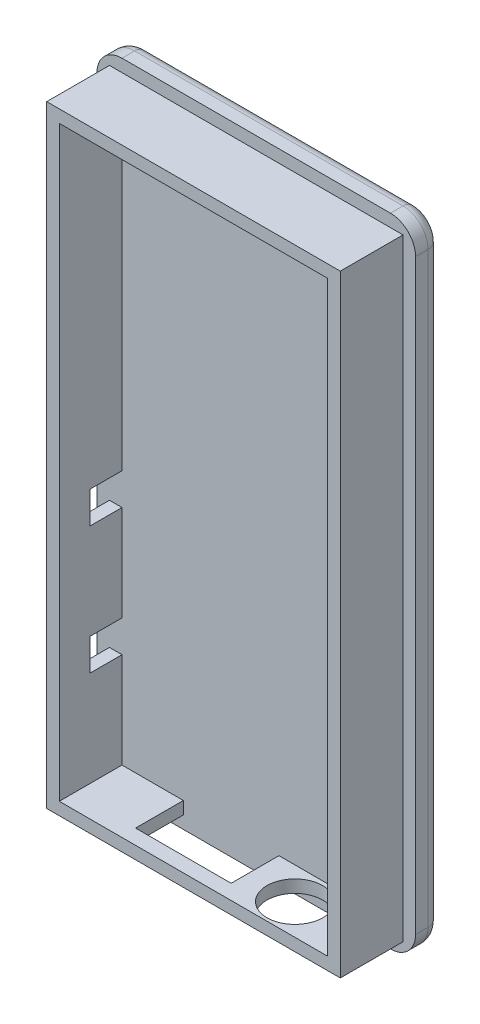
ISO-10303-21;
HEADER;
FILE_DESCRIPTION(('STEP AP214'),'2;1');
FILE_NAME('part.step','',(''),(''),'','','');
FILE_SCHEMA(('AUTOMOTIVE_DESIGN { 1 0 10303 214 1 1 1 1 }'));
ENDSEC;
DATA;
#1=APPLICATION_CONTEXT('core data for automotive mechanical design processes');
#2=APPLICATION_PROTOCOL_DEFINITION('international standard','automotive_design',2000,#1);
#3=PRODUCT_CONTEXT('',#1,'mechanical');
#4=PRODUCT('Part','Part','',(#3));
#5=PRODUCT_RELATED_PRODUCT_CATEGORY('part','',(#4));
#6=PRODUCT_DEFINITION_FORMATION('','',#4);
#7=PRODUCT_DEFINITION_CONTEXT('part definition',#1,'design');
#8=PRODUCT_DEFINITION('design','',#6,#7);
#9=PRODUCT_DEFINITION_SHAPE('','',#8);
#10=(LENGTH_UNIT() NAMED_UNIT(*) SI_UNIT(.MILLI.,.METRE.));
#11=(NAMED_UNIT(*) PLANE_ANGLE_UNIT() SI_UNIT($,.RADIAN.));
#12=(NAMED_UNIT(*) SI_UNIT($,.STERADIAN.) SOLID_ANGLE_UNIT());
#13=UNCERTAINTY_MEASURE_WITH_UNIT(LENGTH_MEASURE(1.E-05),#10,'distance_accuracy_value','');
#14=(GEOMETRIC_REPRESENTATION_CONTEXT(3) GLOBAL_UNCERTAINTY_ASSIGNED_CONTEXT((#13)) GLOBAL_UNIT_ASSIGNED_CONTEXT((#10,
#11,#12)) REPRESENTATION_CONTEXT('',''));
#15=CARTESIAN_POINT('',(0.,0.,0.));
#16=DIRECTION('',(0.,0.,1.));
#17=DIRECTION('',(1.,0.,0.));
#18=AXIS2_PLACEMENT_3D('',#15,#16,#17);
#19=CARTESIAN_POINT('',(0.,0.,2.00000108));
#20=DIRECTION('',(1.,0.,0.));
#21=DIRECTION('',(0.,1.,0.));
#22=AXIS2_PLACEMENT_3D('',#19,#20,#21);
#23=PLANE('',#22);
#24=DIRECTION('',(0.,0.,-1.));
#25=VECTOR('',#24,1.);
#26=CARTESIAN_POINT('',(0.,48.799999936,2.00000108));
#27=LINE('',#26,#25);
#28=CARTESIAN_POINT('',(0.,48.799999936,2.00000108));
#29=VERTEX_POINT('',#28);
#30=CARTESIAN_POINT('',(0.,48.799999936,1.000000032));
#31=VERTEX_POINT('',#30);
#32=EDGE_CURVE('E551',#29,#31,#27,.T.);
#33=ORIENTED_EDGE('',*,*,#32,.T.);
#34=DIRECTION('',(0.,-1.,0.));
#35=VECTOR('',#34,1.);
#36=CARTESIAN_POINT('',(0.,2.000000064,1.000000032));
#37=LINE('',#36,#35);
#38=CARTESIAN_POINT('',(0.,2.000000064,1.000000032));
#39=VERTEX_POINT('',#38);
#40=EDGE_CURVE('E11',#31,#39,#37,.T.);
#41=ORIENTED_EDGE('',*,*,#40,.T.);
#42=DIRECTION('',(0.,0.,-1.));
#43=VECTOR('',#42,1.);
#44=CARTESIAN_POINT('',(0.,2.000000064,2.00000108));
#45=LINE('',#44,#43);
#46=CARTESIAN_POINT('',(0.,2.000000064,2.00000108));
#47=VERTEX_POINT('',#46);
#48=EDGE_CURVE('E553',#39,#47,#45,.F.);
#49=ORIENTED_EDGE('',*,*,#48,.T.);
#50=DIRECTION('',(0.,-1.,0.));
#51=VECTOR('',#50,1.);
#52=CARTESIAN_POINT('',(0.,0.,2.00000108));
#53=LINE('',#52,#51);
#54=EDGE_CURVE('E564',#29,#47,#53,.T.);
#55=ORIENTED_EDGE('',*,*,#54,.F.);
#56=EDGE_LOOP('',(#33,#41,#49,#55));
#57=FACE_BOUND('',#56,.T.);
#58=ADVANCED_FACE('F35',(#57),#23,.F.);
#59=CARTESIAN_POINT('',(0.,0.,2.00000108));
#60=DIRECTION('',(0.,1.,0.));
#61=DIRECTION('',(0.,0.,1.));
#62=AXIS2_PLACEMENT_3D('',#59,#60,#61);
#63=PLANE('',#62);
#64=DIRECTION('',(0.,0.,-1.));
#65=VECTOR('',#64,1.);
#66=CARTESIAN_POINT('',(2.000000064,0.,2.00000108));
#67=LINE('',#66,#65);
#68=CARTESIAN_POINT('',(2.000000064,0.,2.00000108));
#69=VERTEX_POINT('',#68);
#70=CARTESIAN_POINT('',(2.000000064,0.,1.000000032));
#71=VERTEX_POINT('',#70);
#72=EDGE_CURVE('E533',#69,#71,#67,.T.);
#73=ORIENTED_EDGE('',*,*,#72,.T.);
#74=DIRECTION('',(1.,0.,0.));
#75=VECTOR('',#74,1.);
#76=CARTESIAN_POINT('',(23.399999936,0.,1.000000032));
#77=LINE('',#76,#75);
#78=CARTESIAN_POINT('',(23.399999936,0.,1.000000032));
#79=VERTEX_POINT('',#78);
#80=EDGE_CURVE('E507',#71,#79,#77,.T.);
#81=ORIENTED_EDGE('',*,*,#80,.T.);
#82=DIRECTION('',(0.,0.,-1.));
#83=VECTOR('',#82,1.);
#84=CARTESIAN_POINT('',(23.399999936,0.,2.00000108));
#85=LINE('',#84,#83);
#86=CARTESIAN_POINT('',(23.399999936,0.,2.00000108));
#87=VERTEX_POINT('',#86);
#88=EDGE_CURVE('E536',#79,#87,#85,.F.);
#89=ORIENTED_EDGE('',*,*,#88,.T.);
#90=DIRECTION('',(1.,0.,0.));
#91=VECTOR('',#90,1.);
#92=CARTESIAN_POINT('',(0.,0.,2.00000108));
#93=LINE('',#92,#91);
#94=EDGE_CURVE('E561',#69,#87,#93,.T.);
#95=ORIENTED_EDGE('',*,*,#94,.F.);
#96=EDGE_LOOP('',(#73,#81,#89,#95));
#97=FACE_BOUND('',#96,.T.);
#98=ADVANCED_FACE('F409',(#97),#63,.F.);
#99=CARTESIAN_POINT('',(25.4,0.,2.00000108));
#100=DIRECTION('',(-1.,0.,0.));
#101=DIRECTION('',(0.,-1.,0.));
#102=AXIS2_PLACEMENT_3D('',#99,#100,#101);
#103=PLANE('',#102);
#104=DIRECTION('',(0.,0.,-1.));
#105=VECTOR('',#104,1.);
#106=CARTESIAN_POINT('',(25.4,2.000000064,2.00000108));
#107=LINE('',#106,#105);
#108=CARTESIAN_POINT('',(25.4,2.000000064,2.00000108));
#109=VERTEX_POINT('',#108);
#110=CARTESIAN_POINT('',(25.4,2.000000064,1.000000032));
#111=VERTEX_POINT('',#110);
#112=EDGE_CURVE('E528',#109,#111,#107,.T.);
#113=ORIENTED_EDGE('',*,*,#112,.T.);
#114=DIRECTION('',(0.,1.,0.));
#115=VECTOR('',#114,1.);
#116=CARTESIAN_POINT('',(25.4,48.799999936,1.000000032));
#117=LINE('',#116,#115);
#118=CARTESIAN_POINT('',(25.4,48.799999936,1.000000032));
#119=VERTEX_POINT('',#118);
#120=EDGE_CURVE('E474',#111,#119,#117,.T.);
#121=ORIENTED_EDGE('',*,*,#120,.T.);
#122=DIRECTION('',(0.,0.,-1.));
#123=VECTOR('',#122,1.);
#124=CARTESIAN_POINT('',(25.4,48.799999936,2.00000108));
#125=LINE('',#124,#123);
#126=CARTESIAN_POINT('',(25.4,48.799999936,2.00000108));
#127=VERTEX_POINT('',#126);
#128=EDGE_CURVE('E531',#119,#127,#125,.F.);
#129=ORIENTED_EDGE('',*,*,#128,.T.);
#130=DIRECTION('',(0.,1.,0.));
#131=VECTOR('',#130,1.);
#132=CARTESIAN_POINT('',(25.4,0.,2.00000108));
#133=LINE('',#132,#131);
#134=EDGE_CURVE('E558',#109,#127,#133,.T.);
#135=ORIENTED_EDGE('',*,*,#134,.F.);
#136=EDGE_LOOP('',(#113,#121,#129,#135));
#137=FACE_BOUND('',#136,.T.);
#138=ADVANCED_FACE('F415',(#137),#103,.F.);
#139=CARTESIAN_POINT('',(0.,50.8,2.00000108));
#140=DIRECTION('',(0.,-1.,0.));
#141=DIRECTION('',(0.,0.,-1.));
#142=AXIS2_PLACEMENT_3D('',#139,#140,#141);
#143=PLANE('',#142);
#144=DIRECTION('',(0.,0.,-1.));
#145=VECTOR('',#144,1.);
#146=CARTESIAN_POINT('',(23.399999936,50.8,2.00000108));
#147=LINE('',#146,#145);
#148=CARTESIAN_POINT('',(23.399999936,50.8,2.00000108));
#149=VERTEX_POINT('',#148);
#150=CARTESIAN_POINT('',(23.399999936,50.8,1.000000032));
#151=VERTEX_POINT('',#150);
#152=EDGE_CURVE('E548',#149,#151,#147,.T.);
#153=ORIENTED_EDGE('',*,*,#152,.T.);
#154=DIRECTION('',(-1.,0.,0.));
#155=VECTOR('',#154,1.);
#156=CARTESIAN_POINT('',(2.00000006399999,50.8,1.000000032));
#157=LINE('',#156,#155);
#158=CARTESIAN_POINT('',(2.00000006399999,50.8,1.000000032));
#159=VERTEX_POINT('',#158);
#160=EDGE_CURVE('E500',#151,#159,#157,.T.);
#161=ORIENTED_EDGE('',*,*,#160,.T.);
#162=DIRECTION('',(0.,0.,-1.));
#163=VECTOR('',#162,1.);
#164=CARTESIAN_POINT('',(2.00000006399999,50.8,2.00000108));
#165=LINE('',#164,#163);
#166=CARTESIAN_POINT('',(2.00000006399999,50.8,2.00000108));
#167=VERTEX_POINT('',#166);
#168=EDGE_CURVE('E546',#159,#167,#165,.F.);
#169=ORIENTED_EDGE('',*,*,#168,.T.);
#170=DIRECTION('',(-1.,0.,0.));
#171=VECTOR('',#170,1.);
#172=CARTESIAN_POINT('',(0.,50.8,2.00000108));
#173=LINE('',#172,#171);
#174=EDGE_CURVE('E555',#149,#167,#173,.T.);
#175=ORIENTED_EDGE('',*,*,#174,.F.);
#176=EDGE_LOOP('',(#153,#161,#169,#175));
#177=FACE_BOUND('',#176,.T.);
#178=ADVANCED_FACE('F674',(#177),#143,.F.);
#179=CARTESIAN_POINT('',(0.,0.,2.00000108));
#180=DIRECTION('',(0.,0.,-1.));
#181=DIRECTION('',(-1.,0.,0.));
#182=AXIS2_PLACEMENT_3D('',#179,#180,#181);
#183=PLANE('',#182);
#184=DIRECTION('',(0.,-1.,0.));
#185=VECTOR('',#184,1.);
#186=CARTESIAN_POINT('',(1.00000054000001,0.,2.00000108));
#187=LINE('',#186,#185);
#188=CARTESIAN_POINT('',(1.00000054,19.780000064,2.00000108000001));
#189=VERTEX_POINT('',#188);
#190=CARTESIAN_POINT('',(1.00000054,12.160000064,2.00000108));
#191=VERTEX_POINT('',#190);
#192=EDGE_CURVE('E294',#189,#191,#187,.T.);
#193=ORIENTED_EDGE('',*,*,#192,.F.);
#194=DIRECTION('',(-1.,0.,0.));
#195=VECTOR('',#194,1.);
#196=CARTESIAN_POINT('',(25.401,19.780000064,2.00000108000001));
#197=LINE('',#196,#195);
#198=CARTESIAN_POINT('',(2.00000108,19.780000064,2.00000108));
#199=VERTEX_POINT('',#198);
#200=EDGE_CURVE('E60',#199,#189,#197,.T.);
#201=ORIENTED_EDGE('',*,*,#200,.F.);
#202=DIRECTION('',(0.,-1.,0.));
#203=VECTOR('',#202,1.);
#204=CARTESIAN_POINT('',(2.00000108000001,0.,2.00000108));
#205=LINE('',#204,#203);
#206=CARTESIAN_POINT('',(2.00000108000001,12.160000064,2.00000108));
#207=VERTEX_POINT('',#206);
#208=EDGE_CURVE('E269',#199,#207,#205,.T.);
#209=ORIENTED_EDGE('',*,*,#208,.T.);
#210=DIRECTION('',(-1.,0.,0.));
#211=VECTOR('',#210,1.);
#212=CARTESIAN_POINT('',(25.401,12.160000064,2.00000108));
#213=LINE('',#212,#211);
#214=EDGE_CURVE('E355',#207,#191,#213,.T.);
#215=ORIENTED_EDGE('',*,*,#214,.T.);
#216=EDGE_LOOP('',(#193,#201,#209,#215));
#217=FACE_BOUND('',#216,.T.);
#218=CARTESIAN_POINT('',(1.00000054,9.620000064,2.00000108));
#219=VERTEX_POINT('',#218);
#220=CARTESIAN_POINT('',(1.00000054000001,1.00000054,2.00000108));
#221=VERTEX_POINT('',#220);
#222=EDGE_CURVE('E295',#219,#221,#187,.T.);
#223=ORIENTED_EDGE('',*,*,#222,.F.);
#224=DIRECTION('',(-1.,0.,0.));
#225=VECTOR('',#224,1.);
#226=CARTESIAN_POINT('',(25.401,9.62000006400001,2.00000108));
#227=LINE('',#226,#225);
#228=CARTESIAN_POINT('',(2.00000108000001,9.620000064,2.00000108));
#229=VERTEX_POINT('',#228);
#230=EDGE_CURVE('E356',#229,#219,#227,.T.);
#231=ORIENTED_EDGE('',*,*,#230,.F.);
#232=CARTESIAN_POINT('',(2.00000108000001,2.00000108,2.00000108));
#233=VERTEX_POINT('',#232);
#234=EDGE_CURVE('E271',#229,#233,#205,.T.);
#235=ORIENTED_EDGE('',*,*,#234,.T.);
#236=DIRECTION('',(1.,0.,0.));
#237=VECTOR('',#236,1.);
#238=CARTESIAN_POINT('',(0.,2.00000108,2.00000108));
#239=LINE('',#238,#237);
#240=CARTESIAN_POINT('',(6.889999936,2.00000108,2.00000108));
#241=VERTEX_POINT('',#240);
#242=EDGE_CURVE('E277',#233,#241,#239,.T.);
#243=ORIENTED_EDGE('',*,*,#242,.T.);
#244=DIRECTION('',(0.,-1.,0.));
#245=VECTOR('',#244,1.);
#246=CARTESIAN_POINT('',(6.889999936,50.801,2.00000108));
#247=LINE('',#246,#245);
#248=CARTESIAN_POINT('',(6.889999936,1.00000054,2.00000108));
#249=VERTEX_POINT('',#248);
#250=EDGE_CURVE('E336',#241,#249,#247,.T.);
#251=ORIENTED_EDGE('',*,*,#250,.T.);
#252=DIRECTION('',(1.,0.,0.));
#253=VECTOR('',#252,1.);
#254=CARTESIAN_POINT('',(0.,1.00000054,2.00000108));
#255=LINE('',#254,#253);
#256=EDGE_CURVE('E288',#221,#249,#255,.T.);
#257=ORIENTED_EDGE('',*,*,#256,.F.);
#258=EDGE_LOOP('',(#223,#231,#235,#243,#251,#257));
#259=FACE_BOUND('',#258,.T.);
#260=DIRECTION('',(1.,0.,0.));
#261=VECTOR('',#260,1.);
#262=CARTESIAN_POINT('',(0.,49.79999946,2.00000108));
#263=LINE('',#262,#261);
#264=CARTESIAN_POINT('',(1.00000054,49.79999946,2.00000108));
#265=VERTEX_POINT('',#264);
#266=CARTESIAN_POINT('',(24.39999946,49.79999946,2.00000108));
#267=VERTEX_POINT('',#266);
#268=EDGE_CURVE('E296',#265,#267,#263,.T.);
#269=ORIENTED_EDGE('',*,*,#268,.T.);
#270=DIRECTION('',(0.,-1.,0.));
#271=VECTOR('',#270,1.);
#272=CARTESIAN_POINT('',(24.39999946,0.,2.00000108));
#273=LINE('',#272,#271);
#274=CARTESIAN_POINT('',(24.39999946,1.00000054,2.00000108));
#275=VERTEX_POINT('',#274);
#276=EDGE_CURVE('E298',#267,#275,#273,.T.);
#277=ORIENTED_EDGE('',*,*,#276,.T.);
#278=CARTESIAN_POINT('',(14.509999936,1.00000054,2.00000108));
#279=VERTEX_POINT('',#278);
#280=EDGE_CURVE('E291',#279,#275,#255,.T.);
#281=ORIENTED_EDGE('',*,*,#280,.F.);
#282=DIRECTION('',(0.,-1.,0.));
#283=VECTOR('',#282,1.);
#284=CARTESIAN_POINT('',(14.509999936,50.801,2.00000108));
#285=LINE('',#284,#283);
#286=CARTESIAN_POINT('',(14.509999936,2.00000108,2.00000108));
#287=VERTEX_POINT('',#286);
#288=EDGE_CURVE('E330',#287,#279,#285,.T.);
#289=ORIENTED_EDGE('',*,*,#288,.F.);
#290=CARTESIAN_POINT('',(23.39999892,2.00000108,2.00000108));
#291=VERTEX_POINT('',#290);
#292=EDGE_CURVE('E282',#287,#291,#239,.T.);
#293=ORIENTED_EDGE('',*,*,#292,.T.);
#294=DIRECTION('',(0.,-1.,0.));
#295=VECTOR('',#294,1.);
#296=CARTESIAN_POINT('',(23.39999892,0.,2.00000108));
#297=LINE('',#296,#295);
#298=CARTESIAN_POINT('',(23.39999892,48.79999892,2.00000108));
#299=VERTEX_POINT('',#298);
#300=EDGE_CURVE('E283',#299,#291,#297,.T.);
#301=ORIENTED_EDGE('',*,*,#300,.F.);
#302=DIRECTION('',(1.,0.,0.));
#303=VECTOR('',#302,1.);
#304=CARTESIAN_POINT('',(0.,48.79999892,2.00000108));
#305=LINE('',#304,#303);
#306=CARTESIAN_POINT('',(2.00000108,48.79999892,2.00000108));
#307=VERTEX_POINT('',#306);
#308=EDGE_CURVE('E267',#307,#299,#305,.T.);
#309=ORIENTED_EDGE('',*,*,#308,.F.);
#310=CARTESIAN_POINT('',(2.00000108,22.320000064,2.00000108));
#311=VERTEX_POINT('',#310);
#312=EDGE_CURVE('E258',#307,#311,#205,.T.);
#313=ORIENTED_EDGE('',*,*,#312,.T.);
#314=DIRECTION('',(-1.,0.,0.));
#315=VECTOR('',#314,1.);
#316=CARTESIAN_POINT('',(25.401,22.320000064,2.00000108000001));
#317=LINE('',#316,#315);
#318=CARTESIAN_POINT('',(1.00000054,22.320000064,2.00000108));
#319=VERTEX_POINT('',#318);
#320=EDGE_CURVE('E242',#311,#319,#317,.T.);
#321=ORIENTED_EDGE('',*,*,#320,.T.);
#322=EDGE_CURVE('E292',#265,#319,#187,.T.);
#323=ORIENTED_EDGE('',*,*,#322,.F.);
#324=EDGE_LOOP('',(#269,#277,#281,#289,#293,#301,#309,#313,#321,#323));
#325=FACE_BOUND('',#324,.T.);
#326=ORIENTED_EDGE('',*,*,#174,.T.);
#327=CARTESIAN_POINT('',(2.00000006399999,48.799999936,2.00000108));
#328=DIRECTION('',(0.,0.,-1.));
#329=DIRECTION('',(-1.,0.,0.));
#330=AXIS2_PLACEMENT_3D('',#327,#328,#329);
#331=CIRCLE('',#330,2.000000064);
#332=EDGE_CURVE('E538',#167,#29,#331,.F.);
#333=ORIENTED_EDGE('',*,*,#332,.T.);
#334=ORIENTED_EDGE('',*,*,#54,.T.);
#335=CARTESIAN_POINT('',(2.000000064,2.000000064,2.00000108));
#336=DIRECTION('',(0.,0.,-1.));
#337=DIRECTION('',(-1.,0.,0.));
#338=AXIS2_PLACEMENT_3D('',#335,#336,#337);
#339=CIRCLE('',#338,2.000000064);
#340=EDGE_CURVE('E540',#47,#69,#339,.F.);
#341=ORIENTED_EDGE('',*,*,#340,.T.);
#342=ORIENTED_EDGE('',*,*,#94,.T.);
#343=CARTESIAN_POINT('',(23.399999936,2.000000064,2.00000108));
#344=DIRECTION('',(0.,0.,-1.));
#345=DIRECTION('',(-1.,0.,0.));
#346=AXIS2_PLACEMENT_3D('',#343,#344,#345);
#347=CIRCLE('',#346,2.000000064);
#348=EDGE_CURVE('E542',#87,#109,#347,.F.);
#349=ORIENTED_EDGE('',*,*,#348,.T.);
#350=ORIENTED_EDGE('',*,*,#134,.T.);
#351=CARTESIAN_POINT('',(23.399999936,48.799999936,2.00000108));
#352=DIRECTION('',(0.,0.,-1.));
#353=DIRECTION('',(-1.,0.,0.));
#354=AXIS2_PLACEMENT_3D('',#351,#352,#353);
#355=CIRCLE('',#354,2.000000064);
#356=EDGE_CURVE('E544',#127,#149,#355,.F.);
#357=ORIENTED_EDGE('',*,*,#356,.T.);
#358=EDGE_LOOP('',(#326,#333,#334,#341,#342,#349,#350,#357));
#359=FACE_BOUND('',#358,.T.);
#360=ADVANCED_FACE('F263',(#217,#259,#325,#359),#183,.F.);
#361=CARTESIAN_POINT('',(0.,0.,0.));
#362=DIRECTION('',(0.,0.,-1.));
#363=DIRECTION('',(-1.,0.,0.));
#364=AXIS2_PLACEMENT_3D('',#361,#362,#363);
#365=PLANE('',#364);
#366=DIRECTION('',(1.,0.,0.));
#367=VECTOR('',#366,1.);
#368=CARTESIAN_POINT('',(2.000000064,1.000000032,0.));
#369=LINE('',#368,#367);
#370=CARTESIAN_POINT('',(23.399999936,1.000000032,0.));
#371=VERTEX_POINT('',#370);
#372=CARTESIAN_POINT('',(2.000000064,1.000000032,0.));
#373=VERTEX_POINT('',#372);
#374=EDGE_CURVE('E515',#371,#373,#369,.F.);
#375=ORIENTED_EDGE('',*,*,#374,.T.);
#376=CARTESIAN_POINT('',(2.000000064,2.000000064,0.));
#377=DIRECTION('',(0.,0.,-1.));
#378=DIRECTION('',(-1.,0.,0.));
#379=AXIS2_PLACEMENT_3D('',#376,#377,#378);
#380=CIRCLE('',#379,1.000000032);
#381=CARTESIAN_POINT('',(1.000000032,2.000000064,0.));
#382=VERTEX_POINT('',#381);
#383=EDGE_CURVE('E512',#373,#382,#380,.T.);
#384=ORIENTED_EDGE('',*,*,#383,.T.);
#385=DIRECTION('',(0.,-1.,0.));
#386=VECTOR('',#385,1.);
#387=CARTESIAN_POINT('',(1.00000003199999,48.799999936,0.));
#388=LINE('',#387,#386);
#389=CARTESIAN_POINT('',(1.00000003199999,48.799999936,0.));
#390=VERTEX_POINT('',#389);
#391=EDGE_CURVE('E526',#382,#390,#388,.F.);
#392=ORIENTED_EDGE('',*,*,#391,.T.);
#393=CARTESIAN_POINT('',(2.00000006399999,48.799999936,0.));
#394=DIRECTION('',(0.,0.,-1.));
#395=DIRECTION('',(-1.,0.,0.));
#396=AXIS2_PLACEMENT_3D('',#393,#394,#395);
#397=CIRCLE('',#396,1.000000032);
#398=CARTESIAN_POINT('',(2.00000006399999,49.799999968,0.));
#399=VERTEX_POINT('',#398);
#400=EDGE_CURVE('E524',#390,#399,#397,.T.);
#401=ORIENTED_EDGE('',*,*,#400,.T.);
#402=DIRECTION('',(-1.,0.,0.));
#403=VECTOR('',#402,1.);
#404=CARTESIAN_POINT('',(23.399999936,49.799999968,0.));
#405=LINE('',#404,#403);
#406=CARTESIAN_POINT('',(23.399999936,49.799999968,0.));
#407=VERTEX_POINT('',#406);
#408=EDGE_CURVE('E522',#399,#407,#405,.F.);
#409=ORIENTED_EDGE('',*,*,#408,.T.);
#410=CARTESIAN_POINT('',(23.399999936,48.799999936,0.));
#411=DIRECTION('',(0.,0.,-1.));
#412=DIRECTION('',(-1.,0.,0.));
#413=AXIS2_PLACEMENT_3D('',#410,#411,#412);
#414=CIRCLE('',#413,1.000000032);
#415=CARTESIAN_POINT('',(24.399999968,48.799999936,0.));
#416=VERTEX_POINT('',#415);
#417=EDGE_CURVE('E520',#407,#416,#414,.T.);
#418=ORIENTED_EDGE('',*,*,#417,.T.);
#419=DIRECTION('',(0.,1.,0.));
#420=VECTOR('',#419,1.);
#421=CARTESIAN_POINT('',(24.399999968,2.000000064,0.));
#422=LINE('',#421,#420);
#423=CARTESIAN_POINT('',(24.399999968,2.000000064,0.));
#424=VERTEX_POINT('',#423);
#425=EDGE_CURVE('E476',#416,#424,#422,.F.);
#426=ORIENTED_EDGE('',*,*,#425,.T.);
#427=CARTESIAN_POINT('',(23.399999936,2.000000064,0.));
#428=DIRECTION('',(0.,0.,-1.));
#429=DIRECTION('',(-1.,0.,0.));
#430=AXIS2_PLACEMENT_3D('',#427,#428,#429);
#431=CIRCLE('',#430,1.000000032);
#432=EDGE_CURVE('E517',#424,#371,#431,.T.);
#433=ORIENTED_EDGE('',*,*,#432,.T.);
#434=EDGE_LOOP('',(#375,#384,#392,#401,#409,#418,#426,#433));
#435=FACE_BOUND('',#434,.T.);
#436=ADVANCED_FACE('F659',(#435),#365,.T.);
#437=CARTESIAN_POINT('',(0.,48.79999892,7.000000986));
#438=DIRECTION('',(0.,1.,0.));
#439=DIRECTION('',(0.,0.,1.));
#440=AXIS2_PLACEMENT_3D('',#437,#438,#439);
#441=PLANE('',#440);
#442=ORIENTED_EDGE('',*,*,#308,.T.);
#443=DIRECTION('',(0.,0.,-1.));
#444=VECTOR('',#443,1.);
#445=CARTESIAN_POINT('',(23.39999892,48.79999892,7.000000986));
#446=LINE('',#445,#444);
#447=CARTESIAN_POINT('',(23.39999892,48.79999892,7.000000986));
#448=VERTEX_POINT('',#447);
#449=EDGE_CURVE('E567',#448,#299,#446,.T.);
#450=ORIENTED_EDGE('',*,*,#449,.F.);
#451=DIRECTION('',(1.,0.,0.));
#452=VECTOR('',#451,1.);
#453=CARTESIAN_POINT('',(0.,48.79999892,7.000000986));
#454=LINE('',#453,#452);
#455=CARTESIAN_POINT('',(2.00000108,48.79999892,7.000000986));
#456=VERTEX_POINT('',#455);
#457=EDGE_CURVE('E310',#456,#448,#454,.T.);
#458=ORIENTED_EDGE('',*,*,#457,.F.);
#459=DIRECTION('',(0.,0.,-1.));
#460=VECTOR('',#459,1.);
#461=CARTESIAN_POINT('',(2.00000108,48.79999892,7.000000986));
#462=LINE('',#461,#460);
#463=EDGE_CURVE('E571',#456,#307,#462,.T.);
#464=ORIENTED_EDGE('',*,*,#463,.T.);
#465=EDGE_LOOP('',(#442,#450,#458,#464));
#466=FACE_BOUND('',#465,.T.);
#467=ADVANCED_FACE('F588',(#466),#441,.F.);
#468=CARTESIAN_POINT('',(23.39999892,0.,7.000000986));
#469=DIRECTION('',(1.,0.,0.));
#470=DIRECTION('',(0.,1.,0.));
#471=AXIS2_PLACEMENT_3D('',#468,#469,#470);
#472=PLANE('',#471);
#473=ORIENTED_EDGE('',*,*,#300,.T.);
#474=DIRECTION('',(0.,0.,-1.));
#475=VECTOR('',#474,1.);
#476=CARTESIAN_POINT('',(23.39999892,2.00000108,7.000000986));
#477=LINE('',#476,#475);
#478=CARTESIAN_POINT('',(23.39999892,2.00000108,7.000000986));
#479=VERTEX_POINT('',#478);
#480=EDGE_CURVE('E581',#479,#291,#477,.T.);
#481=ORIENTED_EDGE('',*,*,#480,.F.);
#482=DIRECTION('',(0.,-1.,0.));
#483=VECTOR('',#482,1.);
#484=CARTESIAN_POINT('',(23.39999892,0.,7.000000986));
#485=LINE('',#484,#483);
#486=EDGE_CURVE('E308',#448,#479,#485,.T.);
#487=ORIENTED_EDGE('',*,*,#486,.F.);
#488=ORIENTED_EDGE('',*,*,#449,.T.);
#489=EDGE_LOOP('',(#473,#481,#487,#488));
#490=FACE_BOUND('',#489,.T.);
#491=ADVANCED_FACE('F653',(#490),#472,.F.);
#492=CARTESIAN_POINT('',(0.,2.00000108,7.000000986));
#493=DIRECTION('',(0.,1.,0.));
#494=DIRECTION('',(0.,0.,1.));
#495=AXIS2_PLACEMENT_3D('',#492,#493,#494);
#496=PLANE('',#495);
#497=DIRECTION('',(0.,0.,1.));
#498=VECTOR('',#497,1.);
#499=CARTESIAN_POINT('',(14.509999936,2.00000108,5.81000108000002));
#500=LINE('',#499,#498);
#501=CARTESIAN_POINT('',(14.509999936,2.00000108,5.81000108000002));
#502=VERTEX_POINT('',#501);
#503=EDGE_CURVE('E331',#287,#502,#500,.T.);
#504=ORIENTED_EDGE('',*,*,#503,.T.);
#505=DIRECTION('',(-1.,0.,0.));
#506=VECTOR('',#505,1.);
#507=CARTESIAN_POINT('',(14.509999936,2.00000108,5.81000108000002));
#508=LINE('',#507,#506);
#509=CARTESIAN_POINT('',(6.88999993600001,2.00000108,5.81000108000002));
#510=VERTEX_POINT('',#509);
#511=EDGE_CURVE('E335',#502,#510,#508,.T.);
#512=ORIENTED_EDGE('',*,*,#511,.T.);
#513=DIRECTION('',(0.,0.,-1.));
#514=VECTOR('',#513,1.);
#515=CARTESIAN_POINT('',(6.88999993600001,2.00000108,5.81000108000002));
#516=LINE('',#515,#514);
#517=EDGE_CURVE('E338',#510,#241,#516,.T.);
#518=ORIENTED_EDGE('',*,*,#517,.T.);
#519=ORIENTED_EDGE('',*,*,#242,.F.);
#520=DIRECTION('',(0.,0.,-1.));
#521=VECTOR('',#520,1.);
#522=CARTESIAN_POINT('',(2.00000108000001,2.00000108,7.000000986));
#523=LINE('',#522,#521);
#524=CARTESIAN_POINT('',(2.00000108000001,2.00000108,7.000000986));
#525=VERTEX_POINT('',#524);
#526=EDGE_CURVE('E584',#525,#233,#523,.T.);
#527=ORIENTED_EDGE('',*,*,#526,.F.);
#528=DIRECTION('',(1.,0.,0.));
#529=VECTOR('',#528,1.);
#530=CARTESIAN_POINT('',(0.,2.00000108,7.000000986));
#531=LINE('',#530,#529);
#532=EDGE_CURVE('E305',#525,#479,#531,.T.);
#533=ORIENTED_EDGE('',*,*,#532,.T.);
#534=ORIENTED_EDGE('',*,*,#480,.T.);
#535=ORIENTED_EDGE('',*,*,#292,.F.);
#536=EDGE_LOOP('',(#504,#512,#518,#519,#527,#533,#534,#535));
#537=FACE_BOUND('',#536,.T.);
#538=CARTESIAN_POINT('',(18.319999936,2.00000108,4.54000108000002));
#539=DIRECTION('',(0.,1.,0.));
#540=DIRECTION('',(0.,0.,1.));
#541=AXIS2_PLACEMENT_3D('',#538,#539,#540);
#542=CIRCLE('',#541,2.2225);
#543=CARTESIAN_POINT('',(18.319999936,2.00000108,6.76250108000002));
#544=VERTEX_POINT('',#543);
#545=EDGE_CURVE('E323',#544,#544,#542,.F.);
#546=ORIENTED_EDGE('',*,*,#545,.T.);
#547=EDGE_LOOP('',(#546));
#548=FACE_BOUND('',#547,.T.);
#549=ADVANCED_FACE('F595',(#537,#548),#496,.T.);
#550=CARTESIAN_POINT('',(24.39999946,0.,7.000000986));
#551=DIRECTION('',(1.,0.,0.));
#552=DIRECTION('',(0.,1.,0.));
#553=AXIS2_PLACEMENT_3D('',#550,#551,#552);
#554=PLANE('',#553);
#555=ORIENTED_EDGE('',*,*,#276,.F.);
#556=DIRECTION('',(0.,0.,-1.));
#557=VECTOR('',#556,1.);
#558=CARTESIAN_POINT('',(24.39999946,49.79999946,7.000000986));
#559=LINE('',#558,#557);
#560=CARTESIAN_POINT('',(24.39999946,49.79999946,7.000000986));
#561=VERTEX_POINT('',#560);
#562=EDGE_CURVE('E568',#561,#267,#559,.T.);
#563=ORIENTED_EDGE('',*,*,#562,.F.);
#564=DIRECTION('',(0.,-1.,0.));
#565=VECTOR('',#564,1.);
#566=CARTESIAN_POINT('',(24.39999946,0.,7.000000986));
#567=LINE('',#566,#565);
#568=CARTESIAN_POINT('',(24.39999946,1.00000054,7.000000986));
#569=VERTEX_POINT('',#568);
#570=EDGE_CURVE('E268',#561,#569,#567,.T.);
#571=ORIENTED_EDGE('',*,*,#570,.T.);
#572=DIRECTION('',(0.,0.,-1.));
#573=VECTOR('',#572,1.);
#574=CARTESIAN_POINT('',(24.39999946,1.00000054,7.000000986));
#575=LINE('',#574,#573);
#576=EDGE_CURVE('E304',#569,#275,#575,.T.);
#577=ORIENTED_EDGE('',*,*,#576,.T.);
#578=EDGE_LOOP('',(#555,#563,#571,#577));
#579=FACE_BOUND('',#578,.T.);
#580=ADVANCED_FACE('F652',(#579),#554,.T.);
#581=CARTESIAN_POINT('',(0.,49.79999946,7.000000986));
#582=DIRECTION('',(0.,1.,0.));
#583=DIRECTION('',(0.,0.,1.));
#584=AXIS2_PLACEMENT_3D('',#581,#582,#583);
#585=PLANE('',#584);
#586=ORIENTED_EDGE('',*,*,#268,.F.);
#587=DIRECTION('',(0.,0.,-1.));
#588=VECTOR('',#587,1.);
#589=CARTESIAN_POINT('',(1.00000054,49.79999946,7.000000986));
#590=LINE('',#589,#588);
#591=CARTESIAN_POINT('',(1.00000054,49.79999946,7.000000986));
#592=VERTEX_POINT('',#591);
#593=EDGE_CURVE('E572',#592,#265,#590,.T.);
#594=ORIENTED_EDGE('',*,*,#593,.F.);
#595=DIRECTION('',(1.,0.,0.));
#596=VECTOR('',#595,1.);
#597=CARTESIAN_POINT('',(0.,49.79999946,7.000000986));
#598=LINE('',#597,#596);
#599=EDGE_CURVE('E273',#592,#561,#598,.T.);
#600=ORIENTED_EDGE('',*,*,#599,.T.);
#601=ORIENTED_EDGE('',*,*,#562,.T.);
#602=EDGE_LOOP('',(#586,#594,#600,#601));
#603=FACE_BOUND('',#602,.T.);
#604=ADVANCED_FACE('F665',(#603),#585,.T.);
#605=CARTESIAN_POINT('',(1.00000054000001,0.,7.000000986));
#606=DIRECTION('',(1.,0.,0.));
#607=DIRECTION('',(0.,1.,0.));
#608=AXIS2_PLACEMENT_3D('',#605,#606,#607);
#609=PLANE('',#608);
#610=DIRECTION('',(0.,1.,0.));
#611=VECTOR('',#610,1.);
#612=CARTESIAN_POINT('',(1.00000054,22.320000064,4.54000108000002));
#613=LINE('',#612,#611);
#614=CARTESIAN_POINT('',(1.00000054,19.780000064,4.54000108000002));
#615=VERTEX_POINT('',#614);
#616=CARTESIAN_POINT('',(1.00000054,22.320000064,4.54000108000002));
#617=VERTEX_POINT('',#616);
#618=EDGE_CURVE('E385',#615,#617,#613,.T.);
#619=ORIENTED_EDGE('',*,*,#618,.F.);
#620=DIRECTION('',(0.,0.,1.));
#621=VECTOR('',#620,1.);
#622=CARTESIAN_POINT('',(1.00000054,19.780000064,2.00000108000001));
#623=LINE('',#622,#621);
#624=EDGE_CURVE('E261',#189,#615,#623,.T.);
#625=ORIENTED_EDGE('',*,*,#624,.F.);
#626=ORIENTED_EDGE('',*,*,#192,.T.);
#627=DIRECTION('',(0.,0.,-1.));
#628=VECTOR('',#627,1.);
#629=CARTESIAN_POINT('',(1.00000054,12.160000064,2.00000108));
#630=LINE('',#629,#628);
#631=CARTESIAN_POINT('',(1.00000054,12.160000064,4.54000108000002));
#632=VERTEX_POINT('',#631);
#633=EDGE_CURVE('E359',#632,#191,#630,.T.);
#634=ORIENTED_EDGE('',*,*,#633,.F.);
#635=DIRECTION('',(0.,1.,0.));
#636=VECTOR('',#635,1.);
#637=CARTESIAN_POINT('',(1.00000054,12.160000064,4.54000108000002));
#638=LINE('',#637,#636);
#639=CARTESIAN_POINT('',(1.00000054,9.620000064,4.54000108000002));
#640=VERTEX_POINT('',#639);
#641=EDGE_CURVE('E367',#640,#632,#638,.T.);
#642=ORIENTED_EDGE('',*,*,#641,.F.);
#643=DIRECTION('',(0.,0.,1.));
#644=VECTOR('',#643,1.);
#645=CARTESIAN_POINT('',(1.00000054,9.620000064,2.00000108));
#646=LINE('',#645,#644);
#647=EDGE_CURVE('E370',#219,#640,#646,.T.);
#648=ORIENTED_EDGE('',*,*,#647,.F.);
#649=ORIENTED_EDGE('',*,*,#222,.T.);
#650=DIRECTION('',(0.,0.,-1.));
#651=VECTOR('',#650,1.);
#652=CARTESIAN_POINT('',(1.00000054000001,1.00000054,7.000000986));
#653=LINE('',#652,#651);
#654=CARTESIAN_POINT('',(1.00000054000001,1.00000054,7.000000986));
#655=VERTEX_POINT('',#654);
#656=EDGE_CURVE('E575',#655,#221,#653,.T.);
#657=ORIENTED_EDGE('',*,*,#656,.F.);
#658=DIRECTION('',(0.,-1.,0.));
#659=VECTOR('',#658,1.);
#660=CARTESIAN_POINT('',(1.00000054000001,0.,7.000000986));
#661=LINE('',#660,#659);
#662=EDGE_CURVE('E315',#592,#655,#661,.T.);
#663=ORIENTED_EDGE('',*,*,#662,.F.);
#664=ORIENTED_EDGE('',*,*,#593,.T.);
#665=ORIENTED_EDGE('',*,*,#322,.T.);
#666=DIRECTION('',(0.,0.,-1.));
#667=VECTOR('',#666,1.);
#668=CARTESIAN_POINT('',(1.00000054,22.320000064,2.00000108000001));
#669=LINE('',#668,#667);
#670=EDGE_CURVE('E52',#617,#319,#669,.T.);
#671=ORIENTED_EDGE('',*,*,#670,.F.);
#672=EDGE_LOOP('',(#619,#625,#626,#634,#642,#648,#649,#657,#663,#664,#665,#671));
#673=FACE_BOUND('',#672,.T.);
#674=ADVANCED_FACE('F396',(#673),#609,.F.);
#675=CARTESIAN_POINT('',(0.,1.00000054,7.000000986));
#676=DIRECTION('',(0.,1.,0.));
#677=DIRECTION('',(0.,0.,1.));
#678=AXIS2_PLACEMENT_3D('',#675,#676,#677);
#679=PLANE('',#678);
#680=CARTESIAN_POINT('',(18.319999936,1.00000054,4.54000108000002));
#681=DIRECTION('',(0.,-1.,0.));
#682=DIRECTION('',(0.,0.,-1.));
#683=AXIS2_PLACEMENT_3D('',#680,#681,#682);
#684=CIRCLE('',#683,2.2225);
#685=CARTESIAN_POINT('',(18.319999936,1.00000054,2.31750108000002));
#686=VERTEX_POINT('',#685);
#687=EDGE_CURVE('E319',#686,#686,#684,.T.);
#688=ORIENTED_EDGE('',*,*,#687,.F.);
#689=EDGE_LOOP('',(#688));
#690=FACE_BOUND('',#689,.T.);
#691=DIRECTION('',(-1.,0.,0.));
#692=VECTOR('',#691,1.);
#693=CARTESIAN_POINT('',(14.509999936,1.00000054,5.81000108000002));
#694=LINE('',#693,#692);
#695=CARTESIAN_POINT('',(14.509999936,1.00000054,5.81000108000002));
#696=VERTEX_POINT('',#695);
#697=CARTESIAN_POINT('',(6.88999993600001,1.00000054,5.81000108000002));
#698=VERTEX_POINT('',#697);
#699=EDGE_CURVE('E346',#696,#698,#694,.T.);
#700=ORIENTED_EDGE('',*,*,#699,.F.);
#701=DIRECTION('',(0.,0.,1.));
#702=VECTOR('',#701,1.);
#703=CARTESIAN_POINT('',(14.509999936,1.00000054,5.81000108000002));
#704=LINE('',#703,#702);
#705=EDGE_CURVE('E334',#279,#696,#704,.T.);
#706=ORIENTED_EDGE('',*,*,#705,.F.);
#707=ORIENTED_EDGE('',*,*,#280,.T.);
#708=ORIENTED_EDGE('',*,*,#576,.F.);
#709=DIRECTION('',(1.,0.,0.));
#710=VECTOR('',#709,1.);
#711=CARTESIAN_POINT('',(0.,1.00000054,7.000000986));
#712=LINE('',#711,#710);
#713=EDGE_CURVE('E313',#655,#569,#712,.T.);
#714=ORIENTED_EDGE('',*,*,#713,.F.);
#715=ORIENTED_EDGE('',*,*,#656,.T.);
#716=ORIENTED_EDGE('',*,*,#256,.T.);
#717=DIRECTION('',(0.,0.,-1.));
#718=VECTOR('',#717,1.);
#719=CARTESIAN_POINT('',(6.88999993600001,1.00000054,5.81000108000002));
#720=LINE('',#719,#718);
#721=EDGE_CURVE('E326',#698,#249,#720,.T.);
#722=ORIENTED_EDGE('',*,*,#721,.F.);
#723=EDGE_LOOP('',(#700,#706,#707,#708,#714,#715,#716,#722));
#724=FACE_BOUND('',#723,.T.);
#725=ADVANCED_FACE('F608',(#690,#724),#679,.F.);
#726=CARTESIAN_POINT('',(2.00000108000001,0.,7.000000986));
#727=DIRECTION('',(1.,0.,0.));
#728=DIRECTION('',(0.,1.,0.));
#729=AXIS2_PLACEMENT_3D('',#726,#727,#728);
#730=PLANE('',#729);
#731=DIRECTION('',(0.,0.,1.));
#732=VECTOR('',#731,1.);
#733=CARTESIAN_POINT('',(2.00000108,19.780000064,2.00000108000001));
#734=LINE('',#733,#732);
#735=CARTESIAN_POINT('',(2.00000108,19.780000064,4.54000108000002));
#736=VERTEX_POINT('',#735);
#737=EDGE_CURVE('E250',#199,#736,#734,.T.);
#738=ORIENTED_EDGE('',*,*,#737,.T.);
#739=DIRECTION('',(0.,1.,0.));
#740=VECTOR('',#739,1.);
#741=CARTESIAN_POINT('',(2.00000108,22.320000064,4.54000108000002));
#742=LINE('',#741,#740);
#743=CARTESIAN_POINT('',(2.00000108,22.320000064,4.54000108000002));
#744=VERTEX_POINT('',#743);
#745=EDGE_CURVE('E260',#736,#744,#742,.T.);
#746=ORIENTED_EDGE('',*,*,#745,.T.);
#747=DIRECTION('',(0.,0.,-1.));
#748=VECTOR('',#747,1.);
#749=CARTESIAN_POINT('',(2.00000108,22.320000064,2.00000108000001));
#750=LINE('',#749,#748);
#751=EDGE_CURVE('E245',#744,#311,#750,.T.);
#752=ORIENTED_EDGE('',*,*,#751,.T.);
#753=ORIENTED_EDGE('',*,*,#312,.F.);
#754=ORIENTED_EDGE('',*,*,#463,.F.);
#755=DIRECTION('',(0.,-1.,0.));
#756=VECTOR('',#755,1.);
#757=CARTESIAN_POINT('',(2.00000108000001,0.,7.000000986));
#758=LINE('',#757,#756);
#759=EDGE_CURVE('E301',#456,#525,#758,.T.);
#760=ORIENTED_EDGE('',*,*,#759,.T.);
#761=ORIENTED_EDGE('',*,*,#526,.T.);
#762=ORIENTED_EDGE('',*,*,#234,.F.);
#763=DIRECTION('',(0.,0.,1.));
#764=VECTOR('',#763,1.);
#765=CARTESIAN_POINT('',(2.00000108000001,9.620000064,2.00000108));
#766=LINE('',#765,#764);
#767=CARTESIAN_POINT('',(2.00000108000001,9.620000064,4.54000108000002));
#768=VERTEX_POINT('',#767);
#769=EDGE_CURVE('E344',#229,#768,#766,.T.);
#770=ORIENTED_EDGE('',*,*,#769,.T.);
#771=DIRECTION('',(0.,1.,0.));
#772=VECTOR('',#771,1.);
#773=CARTESIAN_POINT('',(2.00000108000001,12.160000064,4.54000108000002));
#774=LINE('',#773,#772);
#775=CARTESIAN_POINT('',(2.00000108000001,12.160000064,4.54000108000002));
#776=VERTEX_POINT('',#775);
#777=EDGE_CURVE('E376',#768,#776,#774,.T.);
#778=ORIENTED_EDGE('',*,*,#777,.T.);
#779=DIRECTION('',(0.,0.,-1.));
#780=VECTOR('',#779,1.);
#781=CARTESIAN_POINT('',(2.00000108000001,12.160000064,2.00000108));
#782=LINE('',#781,#780);
#783=EDGE_CURVE('E373',#776,#207,#782,.T.);
#784=ORIENTED_EDGE('',*,*,#783,.T.);
#785=ORIENTED_EDGE('',*,*,#208,.F.);
#786=EDGE_LOOP('',(#738,#746,#752,#753,#754,#760,#761,#762,#770,#778,#784,#785));
#787=FACE_BOUND('',#786,.T.);
#788=ADVANCED_FACE('F257',(#787),#730,.T.);
#789=CARTESIAN_POINT('',(0.,0.,7.000000986));
#790=DIRECTION('',(0.,0.,1.));
#791=DIRECTION('',(1.,0.,0.));
#792=AXIS2_PLACEMENT_3D('',#789,#790,#791);
#793=PLANE('',#792);
#794=ORIENTED_EDGE('',*,*,#570,.F.);
#795=ORIENTED_EDGE('',*,*,#599,.F.);
#796=ORIENTED_EDGE('',*,*,#662,.T.);
#797=ORIENTED_EDGE('',*,*,#713,.T.);
#798=EDGE_LOOP('',(#794,#795,#796,#797));
#799=FACE_BOUND('',#798,.T.);
#800=ORIENTED_EDGE('',*,*,#457,.T.);
#801=ORIENTED_EDGE('',*,*,#486,.T.);
#802=ORIENTED_EDGE('',*,*,#532,.F.);
#803=ORIENTED_EDGE('',*,*,#759,.F.);
#804=EDGE_LOOP('',(#800,#801,#802,#803));
#805=FACE_BOUND('',#804,.T.);
#806=ADVANCED_FACE('F425',(#799,#805),#793,.T.);
#807=CARTESIAN_POINT('',(2.00000006399999,48.799999936,2.00000108));
#808=DIRECTION('',(0.,0.,-1.));
#809=DIRECTION('',(-1.,0.,0.));
#810=AXIS2_PLACEMENT_3D('',#807,#808,#809);
#811=CYLINDRICAL_SURFACE('',#810,2.000000064);
#812=ORIENTED_EDGE('',*,*,#168,.F.);
#813=CARTESIAN_POINT('',(2.00000006399999,48.799999936,1.000000032));
#814=DIRECTION('',(0.,0.,-1.));
#815=DIRECTION('',(-1.,0.,0.));
#816=AXIS2_PLACEMENT_3D('',#813,#814,#815);
#817=CIRCLE('',#816,2.000000064);
#818=EDGE_CURVE('E44',#159,#31,#817,.F.);
#819=ORIENTED_EDGE('',*,*,#818,.T.);
#820=ORIENTED_EDGE('',*,*,#32,.F.);
#821=ORIENTED_EDGE('',*,*,#332,.F.);
#822=EDGE_LOOP('',(#812,#819,#820,#821));
#823=FACE_BOUND('',#822,.T.);
#824=ADVANCED_FACE('F421',(#823),#811,.T.);
#825=CARTESIAN_POINT('',(2.000000064,2.000000064,2.00000108));
#826=DIRECTION('',(0.,0.,-1.));
#827=DIRECTION('',(-1.,0.,0.));
#828=AXIS2_PLACEMENT_3D('',#825,#826,#827);
#829=CYLINDRICAL_SURFACE('',#828,2.000000064);
#830=ORIENTED_EDGE('',*,*,#48,.F.);
#831=CARTESIAN_POINT('',(2.000000064,2.000000064,1.000000032));
#832=DIRECTION('',(0.,0.,-1.));
#833=DIRECTION('',(-1.,0.,0.));
#834=AXIS2_PLACEMENT_3D('',#831,#832,#833);
#835=CIRCLE('',#834,2.000000064);
#836=EDGE_CURVE('E509',#39,#71,#835,.F.);
#837=ORIENTED_EDGE('',*,*,#836,.T.);
#838=ORIENTED_EDGE('',*,*,#72,.F.);
#839=ORIENTED_EDGE('',*,*,#340,.F.);
#840=EDGE_LOOP('',(#830,#837,#838,#839));
#841=FACE_BOUND('',#840,.T.);
#842=ADVANCED_FACE('F424',(#841),#829,.T.);
#843=CARTESIAN_POINT('',(23.399999936,2.000000064,2.00000108));
#844=DIRECTION('',(0.,0.,-1.));
#845=DIRECTION('',(-1.,0.,0.));
#846=AXIS2_PLACEMENT_3D('',#843,#844,#845);
#847=CYLINDRICAL_SURFACE('',#846,2.000000064);
#848=ORIENTED_EDGE('',*,*,#88,.F.);
#849=CARTESIAN_POINT('',(23.399999936,2.000000064,1.000000032));
#850=DIRECTION('',(0.,0.,-1.));
#851=DIRECTION('',(-1.,0.,0.));
#852=AXIS2_PLACEMENT_3D('',#849,#850,#851);
#853=CIRCLE('',#852,2.000000064);
#854=EDGE_CURVE('E505',#79,#111,#853,.F.);
#855=ORIENTED_EDGE('',*,*,#854,.T.);
#856=ORIENTED_EDGE('',*,*,#112,.F.);
#857=ORIENTED_EDGE('',*,*,#348,.F.);
#858=EDGE_LOOP('',(#848,#855,#856,#857));
#859=FACE_BOUND('',#858,.T.);
#860=ADVANCED_FACE('F429',(#859),#847,.T.);
#861=CARTESIAN_POINT('',(23.399999936,48.799999936,2.00000108));
#862=DIRECTION('',(0.,0.,-1.));
#863=DIRECTION('',(-1.,0.,0.));
#864=AXIS2_PLACEMENT_3D('',#861,#862,#863);
#865=CYLINDRICAL_SURFACE('',#864,2.000000064);
#866=ORIENTED_EDGE('',*,*,#128,.F.);
#867=CARTESIAN_POINT('',(23.399999936,48.799999936,1.000000032));
#868=DIRECTION('',(0.,0.,-1.));
#869=DIRECTION('',(-1.,0.,0.));
#870=AXIS2_PLACEMENT_3D('',#867,#868,#869);
#871=CIRCLE('',#870,2.000000064);
#872=EDGE_CURVE('E502',#119,#151,#871,.F.);
#873=ORIENTED_EDGE('',*,*,#872,.T.);
#874=ORIENTED_EDGE('',*,*,#152,.F.);
#875=ORIENTED_EDGE('',*,*,#356,.F.);
#876=EDGE_LOOP('',(#866,#873,#874,#875));
#877=FACE_BOUND('',#876,.T.);
#878=ADVANCED_FACE('F433',(#877),#865,.T.);
#879=CARTESIAN_POINT('',(23.399999936,48.799999936,1.000000032));
#880=DIRECTION('',(0.,0.,-1.));
#881=DIRECTION('',(-1.,0.,0.));
#882=AXIS2_PLACEMENT_3D('',#879,#880,#881);
#883=DEGENERATE_TOROIDAL_SURFACE('',#882,1.000000032,1.000000032,.T.);
#884=CARTESIAN_POINT('',(23.399999936,49.799999968,1.000000032));
#885=DIRECTION('',(-1.,0.,0.));
#886=DIRECTION('',(0.,0.,1.));
#887=AXIS2_PLACEMENT_3D('',#884,#885,#886);
#888=CIRCLE('',#887,1.000000032);
#889=EDGE_CURVE('E479',#151,#407,#888,.T.);
#890=ORIENTED_EDGE('',*,*,#889,.F.);
#891=ORIENTED_EDGE('',*,*,#872,.F.);
#892=CARTESIAN_POINT('',(24.399999968,48.799999936,1.000000032));
#893=DIRECTION('',(0.,-1.,0.));
#894=DIRECTION('',(0.,0.,-1.));
#895=AXIS2_PLACEMENT_3D('',#892,#893,#894);
#896=CIRCLE('',#895,1.000000032);
#897=EDGE_CURVE('E39',#416,#119,#896,.T.);
#898=ORIENTED_EDGE('',*,*,#897,.F.);
#899=ORIENTED_EDGE('',*,*,#417,.F.);
#900=EDGE_LOOP('',(#890,#891,#898,#899));
#901=FACE_BOUND('',#900,.T.);
#902=ADVANCED_FACE('F37',(#901),#883,.T.);
#903=CARTESIAN_POINT('',(24.399999968,0.,1.000000032));
#904=DIRECTION('',(0.,-1.,0.));
#905=DIRECTION('',(1.,0.,0.));
#906=AXIS2_PLACEMENT_3D('',#903,#904,#905);
#907=CYLINDRICAL_SURFACE('',#906,1.000000032);
#908=ORIENTED_EDGE('',*,*,#897,.T.);
#909=ORIENTED_EDGE('',*,*,#120,.F.);
#910=CARTESIAN_POINT('',(24.399999968,2.000000064,1.000000032));
#911=DIRECTION('',(0.,-1.,0.));
#912=DIRECTION('',(0.,0.,-1.));
#913=AXIS2_PLACEMENT_3D('',#910,#911,#912);
#914=CIRCLE('',#913,1.000000032);
#915=EDGE_CURVE('E481',#424,#111,#914,.T.);
#916=ORIENTED_EDGE('',*,*,#915,.F.);
#917=ORIENTED_EDGE('',*,*,#425,.F.);
#918=EDGE_LOOP('',(#908,#909,#916,#917));
#919=FACE_BOUND('',#918,.T.);
#920=ADVANCED_FACE('F461',(#919),#907,.T.);
#921=CARTESIAN_POINT('',(0.,49.799999968,1.000000032));
#922=DIRECTION('',(1.,0.,0.));
#923=DIRECTION('',(0.,0.,-1.));
#924=AXIS2_PLACEMENT_3D('',#921,#922,#923);
#925=CYLINDRICAL_SURFACE('',#924,1.000000032);
#926=ORIENTED_EDGE('',*,*,#889,.T.);
#927=ORIENTED_EDGE('',*,*,#408,.F.);
#928=CARTESIAN_POINT('',(2.00000006399999,49.799999968,1.000000032));
#929=DIRECTION('',(-1.,0.,0.));
#930=DIRECTION('',(0.,0.,1.));
#931=AXIS2_PLACEMENT_3D('',#928,#929,#930);
#932=CIRCLE('',#931,1.000000032);
#933=EDGE_CURVE('E485',#159,#399,#932,.T.);
#934=ORIENTED_EDGE('',*,*,#933,.F.);
#935=ORIENTED_EDGE('',*,*,#160,.F.);
#936=EDGE_LOOP('',(#926,#927,#934,#935));
#937=FACE_BOUND('',#936,.T.);
#938=ADVANCED_FACE('F458',(#937),#925,.T.);
#939=CARTESIAN_POINT('',(23.399999936,2.000000064,1.000000032));
#940=DIRECTION('',(0.,0.,-1.));
#941=DIRECTION('',(-1.,0.,0.));
#942=AXIS2_PLACEMENT_3D('',#939,#940,#941);
#943=DEGENERATE_TOROIDAL_SURFACE('',#942,1.000000032,1.000000032,.T.);
#944=ORIENTED_EDGE('',*,*,#915,.T.);
#945=ORIENTED_EDGE('',*,*,#854,.F.);
#946=CARTESIAN_POINT('',(23.399999936,1.000000032,1.000000032));
#947=DIRECTION('',(-1.,0.,0.));
#948=DIRECTION('',(0.,0.,1.));
#949=AXIS2_PLACEMENT_3D('',#946,#947,#948);
#950=CIRCLE('',#949,1.000000032);
#951=EDGE_CURVE('E490',#371,#79,#950,.T.);
#952=ORIENTED_EDGE('',*,*,#951,.F.);
#953=ORIENTED_EDGE('',*,*,#432,.F.);
#954=EDGE_LOOP('',(#944,#945,#952,#953));
#955=FACE_BOUND('',#954,.T.);
#956=ADVANCED_FACE('F454',(#955),#943,.T.);
#957=CARTESIAN_POINT('',(2.00000006399999,48.799999936,1.000000032));
#958=DIRECTION('',(0.,0.,-1.));
#959=DIRECTION('',(-1.,0.,0.));
#960=AXIS2_PLACEMENT_3D('',#957,#958,#959);
#961=DEGENERATE_TOROIDAL_SURFACE('',#960,1.000000032,1.000000032,.T.);
#962=ORIENTED_EDGE('',*,*,#933,.T.);
#963=ORIENTED_EDGE('',*,*,#400,.F.);
#964=CARTESIAN_POINT('',(1.00000003199999,48.799999936,1.000000032));
#965=DIRECTION('',(0.,-1.,0.));
#966=DIRECTION('',(0.,0.,-1.));
#967=AXIS2_PLACEMENT_3D('',#964,#965,#966);
#968=CIRCLE('',#967,1.000000032);
#969=EDGE_CURVE('E493',#31,#390,#968,.T.);
#970=ORIENTED_EDGE('',*,*,#969,.F.);
#971=ORIENTED_EDGE('',*,*,#818,.F.);
#972=EDGE_LOOP('',(#962,#963,#970,#971));
#973=FACE_BOUND('',#972,.T.);
#974=ADVANCED_FACE('F450',(#973),#961,.T.);
#975=CARTESIAN_POINT('',(0.,1.000000032,1.000000032));
#976=DIRECTION('',(-1.,0.,0.));
#977=DIRECTION('',(0.,0.,1.));
#978=AXIS2_PLACEMENT_3D('',#975,#976,#977);
#979=CYLINDRICAL_SURFACE('',#978,1.000000032);
#980=ORIENTED_EDGE('',*,*,#951,.T.);
#981=ORIENTED_EDGE('',*,*,#80,.F.);
#982=CARTESIAN_POINT('',(2.000000064,1.000000032,1.000000032));
#983=DIRECTION('',(-1.,0.,0.));
#984=DIRECTION('',(0.,0.,1.));
#985=AXIS2_PLACEMENT_3D('',#982,#983,#984);
#986=CIRCLE('',#985,1.000000032);
#987=EDGE_CURVE('E496',#373,#71,#986,.T.);
#988=ORIENTED_EDGE('',*,*,#987,.F.);
#989=ORIENTED_EDGE('',*,*,#374,.F.);
#990=EDGE_LOOP('',(#980,#981,#988,#989));
#991=FACE_BOUND('',#990,.T.);
#992=ADVANCED_FACE('F446',(#991),#979,.T.);
#993=CARTESIAN_POINT('',(1.000000032,0.,1.000000032));
#994=DIRECTION('',(0.,1.,0.));
#995=DIRECTION('',(-1.,0.,0.));
#996=AXIS2_PLACEMENT_3D('',#993,#994,#995);
#997=CYLINDRICAL_SURFACE('',#996,1.000000032);
#998=ORIENTED_EDGE('',*,*,#969,.T.);
#999=ORIENTED_EDGE('',*,*,#391,.F.);
#1000=CARTESIAN_POINT('',(1.000000032,2.000000064,1.000000032));
#1001=DIRECTION('',(0.,-1.,0.));
#1002=DIRECTION('',(0.,0.,-1.));
#1003=AXIS2_PLACEMENT_3D('',#1000,#1001,#1002);
#1004=CIRCLE('',#1003,1.000000032);
#1005=EDGE_CURVE('E322',#39,#382,#1004,.T.);
#1006=ORIENTED_EDGE('',*,*,#1005,.F.);
#1007=ORIENTED_EDGE('',*,*,#40,.F.);
#1008=EDGE_LOOP('',(#998,#999,#1006,#1007));
#1009=FACE_BOUND('',#1008,.T.);
#1010=ADVANCED_FACE('F442',(#1009),#997,.T.);
#1011=CARTESIAN_POINT('',(2.000000064,2.000000064,1.000000032));
#1012=DIRECTION('',(0.,0.,-1.));
#1013=DIRECTION('',(-1.,0.,0.));
#1014=AXIS2_PLACEMENT_3D('',#1011,#1012,#1013);
#1015=DEGENERATE_TOROIDAL_SURFACE('',#1014,1.000000032,1.000000032,.T.);
#1016=ORIENTED_EDGE('',*,*,#987,.T.);
#1017=ORIENTED_EDGE('',*,*,#836,.F.);
#1018=ORIENTED_EDGE('',*,*,#1005,.T.);
#1019=ORIENTED_EDGE('',*,*,#383,.F.);
#1020=EDGE_LOOP('',(#1016,#1017,#1018,#1019));
#1021=FACE_BOUND('',#1020,.T.);
#1022=ADVANCED_FACE('F438',(#1021),#1015,.T.);
#1023=CARTESIAN_POINT('',(18.319999936,50.801,4.54000108000002));
#1024=DIRECTION('',(0.,-1.,0.));
#1025=DIRECTION('',(0.,0.,-1.));
#1026=AXIS2_PLACEMENT_3D('',#1023,#1024,#1025);
#1027=CYLINDRICAL_SURFACE('',#1026,2.2225);
#1028=ORIENTED_EDGE('',*,*,#545,.F.);
#1029=EDGE_LOOP('',(#1028));
#1030=FACE_BOUND('',#1029,.T.);
#1031=ORIENTED_EDGE('',*,*,#687,.T.);
#1032=EDGE_LOOP('',(#1031));
#1033=FACE_BOUND('',#1032,.T.);
#1034=ADVANCED_FACE('F441',(#1030,#1033),#1027,.F.);
#1035=CARTESIAN_POINT('',(14.509999936,50.801,5.81000108000002));
#1036=DIRECTION('',(1.,0.,0.));
#1037=DIRECTION('',(0.,0.,-1.));
#1038=AXIS2_PLACEMENT_3D('',#1035,#1036,#1037);
#1039=PLANE('',#1038);
#1040=ORIENTED_EDGE('',*,*,#288,.T.);
#1041=ORIENTED_EDGE('',*,*,#705,.T.);
#1042=DIRECTION('',(0.,-1.,0.));
#1043=VECTOR('',#1042,1.);
#1044=CARTESIAN_POINT('',(14.509999936,50.801,5.81000108000002));
#1045=LINE('',#1044,#1043);
#1046=EDGE_CURVE('E327',#502,#696,#1045,.T.);
#1047=ORIENTED_EDGE('',*,*,#1046,.F.);
#1048=ORIENTED_EDGE('',*,*,#503,.F.);
#1049=EDGE_LOOP('',(#1040,#1041,#1047,#1048));
#1050=FACE_BOUND('',#1049,.T.);
#1051=ADVANCED_FACE('F638',(#1050),#1039,.F.);
#1052=CARTESIAN_POINT('',(6.88999993600001,50.801,5.81000108000002));
#1053=DIRECTION('',(-1.,0.,0.));
#1054=DIRECTION('',(0.,0.,1.));
#1055=AXIS2_PLACEMENT_3D('',#1052,#1053,#1054);
#1056=PLANE('',#1055);
#1057=DIRECTION('',(0.,-1.,0.));
#1058=VECTOR('',#1057,1.);
#1059=CARTESIAN_POINT('',(6.88999993600001,50.801,5.81000108000002));
#1060=LINE('',#1059,#1058);
#1061=EDGE_CURVE('E332',#510,#698,#1060,.T.);
#1062=ORIENTED_EDGE('',*,*,#1061,.T.);
#1063=ORIENTED_EDGE('',*,*,#721,.T.);
#1064=ORIENTED_EDGE('',*,*,#250,.F.);
#1065=ORIENTED_EDGE('',*,*,#517,.F.);
#1066=EDGE_LOOP('',(#1062,#1063,#1064,#1065));
#1067=FACE_BOUND('',#1066,.T.);
#1068=ADVANCED_FACE('F600',(#1067),#1056,.F.);
#1069=CARTESIAN_POINT('',(14.509999936,50.801,5.81000108000002));
#1070=DIRECTION('',(0.,0.,1.));
#1071=DIRECTION('',(1.,0.,0.));
#1072=AXIS2_PLACEMENT_3D('',#1069,#1070,#1071);
#1073=PLANE('',#1072);
#1074=ORIENTED_EDGE('',*,*,#1046,.T.);
#1075=ORIENTED_EDGE('',*,*,#699,.T.);
#1076=ORIENTED_EDGE('',*,*,#1061,.F.);
#1077=ORIENTED_EDGE('',*,*,#511,.F.);
#1078=EDGE_LOOP('',(#1074,#1075,#1076,#1077));
#1079=FACE_BOUND('',#1078,.T.);
#1080=ADVANCED_FACE('F602',(#1079),#1073,.F.);
#1081=CARTESIAN_POINT('',(25.401,9.62000006400001,2.00000108));
#1082=DIRECTION('',(0.,-1.,0.));
#1083=DIRECTION('',(1.,0.,0.));
#1084=AXIS2_PLACEMENT_3D('',#1081,#1082,#1083);
#1085=PLANE('',#1084);
#1086=ORIENTED_EDGE('',*,*,#230,.T.);
#1087=ORIENTED_EDGE('',*,*,#647,.T.);
#1088=DIRECTION('',(-1.,0.,0.));
#1089=VECTOR('',#1088,1.);
#1090=CARTESIAN_POINT('',(25.401,9.62000006400001,4.54000108000002));
#1091=LINE('',#1090,#1089);
#1092=EDGE_CURVE('E358',#768,#640,#1091,.T.);
#1093=ORIENTED_EDGE('',*,*,#1092,.F.);
#1094=ORIENTED_EDGE('',*,*,#769,.F.);
#1095=EDGE_LOOP('',(#1086,#1087,#1093,#1094));
#1096=FACE_BOUND('',#1095,.T.);
#1097=ADVANCED_FACE('F625',(#1096),#1085,.F.);
#1098=CARTESIAN_POINT('',(25.401,12.160000064,4.54000108000002));
#1099=DIRECTION('',(0.,0.,1.));
#1100=DIRECTION('',(1.,0.,0.));
#1101=AXIS2_PLACEMENT_3D('',#1098,#1099,#1100);
#1102=PLANE('',#1101);
#1103=ORIENTED_EDGE('',*,*,#1092,.T.);
#1104=ORIENTED_EDGE('',*,*,#641,.T.);
#1105=DIRECTION('',(-1.,0.,0.));
#1106=VECTOR('',#1105,1.);
#1107=CARTESIAN_POINT('',(25.401,12.160000064,4.54000108000002));
#1108=LINE('',#1107,#1106);
#1109=EDGE_CURVE('E361',#776,#632,#1108,.T.);
#1110=ORIENTED_EDGE('',*,*,#1109,.F.);
#1111=ORIENTED_EDGE('',*,*,#777,.F.);
#1112=EDGE_LOOP('',(#1103,#1104,#1110,#1111));
#1113=FACE_BOUND('',#1112,.T.);
#1114=ADVANCED_FACE('F622',(#1113),#1102,.F.);
#1115=CARTESIAN_POINT('',(25.401,12.160000064,2.00000108));
#1116=DIRECTION('',(0.,1.,0.));
#1117=DIRECTION('',(-1.,0.,0.));
#1118=AXIS2_PLACEMENT_3D('',#1115,#1116,#1117);
#1119=PLANE('',#1118);
#1120=ORIENTED_EDGE('',*,*,#1109,.T.);
#1121=ORIENTED_EDGE('',*,*,#633,.T.);
#1122=ORIENTED_EDGE('',*,*,#214,.F.);
#1123=ORIENTED_EDGE('',*,*,#783,.F.);
#1124=EDGE_LOOP('',(#1120,#1121,#1122,#1123));
#1125=FACE_BOUND('',#1124,.T.);
#1126=ADVANCED_FACE('F406',(#1125),#1119,.F.);
#1127=CARTESIAN_POINT('',(25.401,19.780000064,2.00000108000001));
#1128=DIRECTION('',(0.,-1.,0.));
#1129=DIRECTION('',(1.,0.,0.));
#1130=AXIS2_PLACEMENT_3D('',#1127,#1128,#1129);
#1131=PLANE('',#1130);
#1132=ORIENTED_EDGE('',*,*,#200,.T.);
#1133=ORIENTED_EDGE('',*,*,#624,.T.);
#1134=DIRECTION('',(-1.,0.,0.));
#1135=VECTOR('',#1134,1.);
#1136=CARTESIAN_POINT('',(25.401,19.780000064,4.54000108000002));
#1137=LINE('',#1136,#1135);
#1138=EDGE_CURVE('E381',#736,#615,#1137,.T.);
#1139=ORIENTED_EDGE('',*,*,#1138,.F.);
#1140=ORIENTED_EDGE('',*,*,#737,.F.);
#1141=EDGE_LOOP('',(#1132,#1133,#1139,#1140));
#1142=FACE_BOUND('',#1141,.T.);
#1143=ADVANCED_FACE('F394',(#1142),#1131,.F.);
#1144=CARTESIAN_POINT('',(25.401,22.320000064,4.54000108000002));
#1145=DIRECTION('',(0.,0.,1.));
#1146=DIRECTION('',(1.,0.,0.));
#1147=AXIS2_PLACEMENT_3D('',#1144,#1145,#1146);
#1148=PLANE('',#1147);
#1149=ORIENTED_EDGE('',*,*,#1138,.T.);
#1150=ORIENTED_EDGE('',*,*,#618,.T.);
#1151=DIRECTION('',(-1.,0.,0.));
#1152=VECTOR('',#1151,1.);
#1153=CARTESIAN_POINT('',(25.401,22.320000064,4.54000108000002));
#1154=LINE('',#1153,#1152);
#1155=EDGE_CURVE('E251',#744,#617,#1154,.T.);
#1156=ORIENTED_EDGE('',*,*,#1155,.F.);
#1157=ORIENTED_EDGE('',*,*,#745,.F.);
#1158=EDGE_LOOP('',(#1149,#1150,#1156,#1157));
#1159=FACE_BOUND('',#1158,.T.);
#1160=ADVANCED_FACE('F398',(#1159),#1148,.F.);
#1161=CARTESIAN_POINT('',(25.401,22.320000064,2.00000108000001));
#1162=DIRECTION('',(0.,1.,0.));
#1163=DIRECTION('',(-1.,0.,0.));
#1164=AXIS2_PLACEMENT_3D('',#1161,#1162,#1163);
#1165=PLANE('',#1164);
#1166=ORIENTED_EDGE('',*,*,#1155,.T.);
#1167=ORIENTED_EDGE('',*,*,#670,.T.);
#1168=ORIENTED_EDGE('',*,*,#320,.F.);
#1169=ORIENTED_EDGE('',*,*,#751,.F.);
#1170=EDGE_LOOP('',(#1166,#1167,#1168,#1169));
#1171=FACE_BOUND('',#1170,.T.);
#1172=ADVANCED_FACE('F244',(#1171),#1165,.F.);
#1173=CLOSED_SHELL('',(#58,#98,#138,#178,#360,#436,#467,#491,#549,#580,#604,#674,#725,#788,#806,
#824,#842,#860,#878,#902,#920,#938,#956,#974,#992,#1010,#1022,#1034,#1051,#1068,#1080,#1097,
#1114,#1126,#1143,#1160,#1172));
#1174=MANIFOLD_SOLID_BREP('B2',#1173);
#1175=ADVANCED_BREP_SHAPE_REPRESENTATION('',(#18,#1174),#14);
#1176=SHAPE_DEFINITION_REPRESENTATION(#9,#1175);
ENDSEC;
END-ISO-10303-21;
